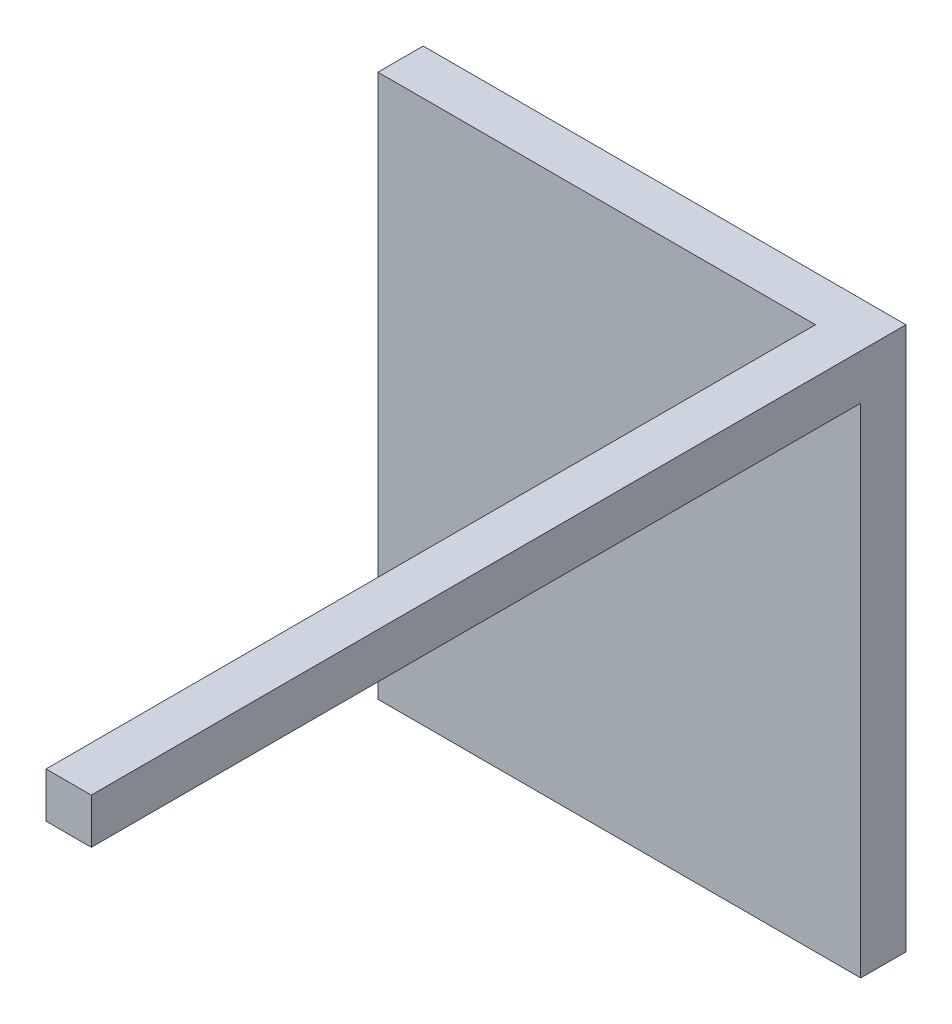
ISO-10303-21;
HEADER;
FILE_DESCRIPTION(('STEP AP214'),'2;1');
FILE_NAME('part.step','',(''),(''),'','','');
FILE_SCHEMA(('AUTOMOTIVE_DESIGN { 1 0 10303 214 1 1 1 1 }'));
ENDSEC;
DATA;
#1=APPLICATION_CONTEXT('core data for automotive mechanical design processes');
#2=APPLICATION_PROTOCOL_DEFINITION('international standard','automotive_design',2000,#1);
#3=PRODUCT_CONTEXT('',#1,'mechanical');
#4=PRODUCT('Part','Part','',(#3));
#5=PRODUCT_RELATED_PRODUCT_CATEGORY('part','',(#4));
#6=PRODUCT_DEFINITION_FORMATION('','',#4);
#7=PRODUCT_DEFINITION_CONTEXT('part definition',#1,'design');
#8=PRODUCT_DEFINITION('design','',#6,#7);
#9=PRODUCT_DEFINITION_SHAPE('','',#8);
#10=(LENGTH_UNIT() NAMED_UNIT(*) SI_UNIT(.MILLI.,.METRE.));
#11=(NAMED_UNIT(*) PLANE_ANGLE_UNIT() SI_UNIT($,.RADIAN.));
#12=(NAMED_UNIT(*) SI_UNIT($,.STERADIAN.) SOLID_ANGLE_UNIT());
#13=UNCERTAINTY_MEASURE_WITH_UNIT(LENGTH_MEASURE(1.E-05),#10,'distance_accuracy_value','');
#14=(GEOMETRIC_REPRESENTATION_CONTEXT(3) GLOBAL_UNCERTAINTY_ASSIGNED_CONTEXT((#13)) GLOBAL_UNIT_ASSIGNED_CONTEXT((#10,
#11,#12)) REPRESENTATION_CONTEXT('',''));
#15=CARTESIAN_POINT('',(0.,0.,0.));
#16=DIRECTION('',(0.,0.,1.));
#17=DIRECTION('',(1.,0.,0.));
#18=AXIS2_PLACEMENT_3D('',#15,#16,#17);
#19=CARTESIAN_POINT('',(0.,228.6,38.1));
#20=DIRECTION('',(-1.,0.,0.));
#21=DIRECTION('',(0.,0.,1.));
#22=AXIS2_PLACEMENT_3D('',#19,#20,#21);
#23=PLANE('',#22);
#24=DIRECTION('',(0.,1.,0.));
#25=VECTOR('',#24,1.);
#26=CARTESIAN_POINT('',(0.,228.6,0.));
#27=LINE('',#26,#25);
#28=CARTESIAN_POINT('',(0.,0.,0.));
#29=VERTEX_POINT('',#28);
#30=CARTESIAN_POINT('',(0.,457.2,0.));
#31=VERTEX_POINT('',#30);
#32=EDGE_CURVE('E119',#29,#31,#27,.T.);
#33=ORIENTED_EDGE('',*,*,#32,.F.);
#34=DIRECTION('',(0.,0.,-1.));
#35=VECTOR('',#34,1.);
#36=CARTESIAN_POINT('',(0.,0.,38.1));
#37=LINE('',#36,#35);
#38=CARTESIAN_POINT('',(0.,0.,38.1));
#39=VERTEX_POINT('',#38);
#40=EDGE_CURVE('E10',#39,#29,#37,.T.);
#41=ORIENTED_EDGE('',*,*,#40,.F.);
#42=DIRECTION('',(0.,1.,0.));
#43=VECTOR('',#42,1.);
#44=CARTESIAN_POINT('',(0.,228.6,38.1));
#45=LINE('',#44,#43);
#46=CARTESIAN_POINT('',(0.,457.2,38.1));
#47=VERTEX_POINT('',#46);
#48=EDGE_CURVE('E132',#39,#47,#45,.T.);
#49=ORIENTED_EDGE('',*,*,#48,.T.);
#50=DIRECTION('',(0.,0.,-1.));
#51=VECTOR('',#50,1.);
#52=CARTESIAN_POINT('',(0.,457.2,38.1));
#53=LINE('',#52,#51);
#54=EDGE_CURVE('E145',#47,#31,#53,.T.);
#55=ORIENTED_EDGE('',*,*,#54,.T.);
#56=EDGE_LOOP('',(#33,#41,#49,#55));
#57=FACE_BOUND('',#56,.T.);
#58=ADVANCED_FACE('F17',(#57),#23,.T.);
#59=CARTESIAN_POINT('',(213.359993903296,0.,38.1));
#60=DIRECTION('',(0.,1.,0.));
#61=DIRECTION('',(0.,0.,1.));
#62=AXIS2_PLACEMENT_3D('',#59,#60,#61);
#63=PLANE('',#62);
#64=DIRECTION('',(1.,0.,0.));
#65=VECTOR('',#64,1.);
#66=CARTESIAN_POINT('',(213.359993903296,0.,0.));
#67=LINE('',#66,#65);
#68=CARTESIAN_POINT('',(406.4,0.,0.));
#69=VERTEX_POINT('',#68);
#70=EDGE_CURVE('E126',#29,#69,#67,.T.);
#71=ORIENTED_EDGE('',*,*,#70,.T.);
#72=DIRECTION('',(0.,0.,-1.));
#73=VECTOR('',#72,1.);
#74=CARTESIAN_POINT('',(406.4,0.,38.1));
#75=LINE('',#74,#73);
#76=CARTESIAN_POINT('',(406.4,0.,38.1));
#77=VERTEX_POINT('',#76);
#78=EDGE_CURVE('E25',#77,#69,#75,.T.);
#79=ORIENTED_EDGE('',*,*,#78,.F.);
#80=DIRECTION('',(1.,0.,0.));
#81=VECTOR('',#80,1.);
#82=CARTESIAN_POINT('',(213.359993903296,0.,38.1));
#83=LINE('',#82,#81);
#84=EDGE_CURVE('E136',#39,#77,#83,.T.);
#85=ORIENTED_EDGE('',*,*,#84,.F.);
#86=ORIENTED_EDGE('',*,*,#40,.T.);
#87=EDGE_LOOP('',(#71,#79,#85,#86));
#88=FACE_BOUND('',#87,.T.);
#89=ADVANCED_FACE('F190',(#88),#63,.F.);
#90=CARTESIAN_POINT('',(406.4,228.6,38.1));
#91=DIRECTION('',(-1.,0.,0.));
#92=DIRECTION('',(0.,-1.,0.));
#93=AXIS2_PLACEMENT_3D('',#90,#91,#92);
#94=PLANE('',#93);
#95=DIRECTION('',(0.,1.,0.));
#96=VECTOR('',#95,1.);
#97=CARTESIAN_POINT('',(406.4,228.6,0.));
#98=LINE('',#97,#96);
#99=CARTESIAN_POINT('',(406.4,457.2,0.));
#100=VERTEX_POINT('',#99);
#101=EDGE_CURVE('E149',#69,#100,#98,.T.);
#102=ORIENTED_EDGE('',*,*,#101,.T.);
#103=DIRECTION('',(0.,0.,-1.));
#104=VECTOR('',#103,1.);
#105=CARTESIAN_POINT('',(406.4,457.2,38.1));
#106=LINE('',#105,#104);
#107=CARTESIAN_POINT('',(406.4,457.2,685.8));
#108=VERTEX_POINT('',#107);
#109=EDGE_CURVE('E158',#108,#100,#106,.T.);
#110=ORIENTED_EDGE('',*,*,#109,.F.);
#111=DIRECTION('',(0.,1.,0.));
#112=VECTOR('',#111,1.);
#113=CARTESIAN_POINT('',(406.4,228.6,685.8));
#114=LINE('',#113,#112);
#115=CARTESIAN_POINT('',(406.4,419.1,685.8));
#116=VERTEX_POINT('',#115);
#117=EDGE_CURVE('E105',#116,#108,#114,.T.);
#118=ORIENTED_EDGE('',*,*,#117,.F.);
#119=DIRECTION('',(0.,0.,-1.));
#120=VECTOR('',#119,1.);
#121=CARTESIAN_POINT('',(406.4,419.1,685.8));
#122=LINE('',#121,#120);
#123=CARTESIAN_POINT('',(406.4,419.1,38.1));
#124=VERTEX_POINT('',#123);
#125=EDGE_CURVE('E100',#116,#124,#122,.T.);
#126=ORIENTED_EDGE('',*,*,#125,.T.);
#127=DIRECTION('',(0.,1.,0.));
#128=VECTOR('',#127,1.);
#129=CARTESIAN_POINT('',(406.4,228.6,38.1));
#130=LINE('',#129,#128);
#131=EDGE_CURVE('E140',#77,#124,#130,.T.);
#132=ORIENTED_EDGE('',*,*,#131,.F.);
#133=ORIENTED_EDGE('',*,*,#78,.T.);
#134=EDGE_LOOP('',(#102,#110,#118,#126,#132,#133));
#135=FACE_BOUND('',#134,.T.);
#136=ADVANCED_FACE('F167',(#135),#94,.F.);
#137=CARTESIAN_POINT('',(243.840006096703,457.2,38.1));
#138=DIRECTION('',(0.,1.,0.));
#139=DIRECTION('',(0.,0.,1.));
#140=AXIS2_PLACEMENT_3D('',#137,#138,#139);
#141=PLANE('',#140);
#142=DIRECTION('',(1.,0.,0.));
#143=VECTOR('',#142,1.);
#144=CARTESIAN_POINT('',(243.840006096703,457.2,0.));
#145=LINE('',#144,#143);
#146=EDGE_CURVE('E137',#31,#100,#145,.T.);
#147=ORIENTED_EDGE('',*,*,#146,.F.);
#148=ORIENTED_EDGE('',*,*,#54,.F.);
#149=DIRECTION('',(1.,0.,0.));
#150=VECTOR('',#149,1.);
#151=CARTESIAN_POINT('',(243.840006096703,457.2,38.1));
#152=LINE('',#151,#150);
#153=CARTESIAN_POINT('',(368.3,457.2,38.1));
#154=VERTEX_POINT('',#153);
#155=EDGE_CURVE('E143',#47,#154,#152,.T.);
#156=ORIENTED_EDGE('',*,*,#155,.T.);
#157=DIRECTION('',(0.,0.,-1.));
#158=VECTOR('',#157,1.);
#159=CARTESIAN_POINT('',(368.3,457.2,685.8));
#160=LINE('',#159,#158);
#161=CARTESIAN_POINT('',(368.3,457.2,685.8));
#162=VERTEX_POINT('',#161);
#163=EDGE_CURVE('E128',#162,#154,#160,.T.);
#164=ORIENTED_EDGE('',*,*,#163,.F.);
#165=DIRECTION('',(1.,0.,0.));
#166=VECTOR('',#165,1.);
#167=CARTESIAN_POINT('',(243.840006096703,457.2,685.8));
#168=LINE('',#167,#166);
#169=EDGE_CURVE('E112',#162,#108,#168,.T.);
#170=ORIENTED_EDGE('',*,*,#169,.T.);
#171=ORIENTED_EDGE('',*,*,#109,.T.);
#172=EDGE_LOOP('',(#147,#148,#156,#164,#170,#171));
#173=FACE_BOUND('',#172,.T.);
#174=ADVANCED_FACE('F176',(#173),#141,.T.);
#175=CARTESIAN_POINT('',(203.2,228.6,38.1));
#176=DIRECTION('',(0.,0.,1.));
#177=DIRECTION('',(1.,0.,0.));
#178=AXIS2_PLACEMENT_3D('',#175,#176,#177);
#179=PLANE('',#178);
#180=DIRECTION('',(0.,-1.,0.));
#181=VECTOR('',#180,1.);
#182=CARTESIAN_POINT('',(368.3,446.850213599205,38.1));
#183=LINE('',#182,#181);
#184=CARTESIAN_POINT('',(368.3,419.1,38.1));
#185=VERTEX_POINT('',#184);
#186=EDGE_CURVE('E44',#154,#185,#183,.T.);
#187=ORIENTED_EDGE('',*,*,#186,.F.);
#188=ORIENTED_EDGE('',*,*,#155,.F.);
#189=ORIENTED_EDGE('',*,*,#48,.F.);
#190=ORIENTED_EDGE('',*,*,#84,.T.);
#191=ORIENTED_EDGE('',*,*,#131,.T.);
#192=DIRECTION('',(1.,0.,0.));
#193=VECTOR('',#192,1.);
#194=CARTESIAN_POINT('',(431.796451067925,419.1,38.1));
#195=LINE('',#194,#193);
#196=EDGE_CURVE('E37',#185,#124,#195,.T.);
#197=ORIENTED_EDGE('',*,*,#196,.F.);
#198=EDGE_LOOP('',(#187,#188,#189,#190,#191,#197));
#199=FACE_BOUND('',#198,.T.);
#200=ADVANCED_FACE('F188',(#199),#179,.T.);
#201=CARTESIAN_POINT('',(203.2,228.6,0.));
#202=DIRECTION('',(0.,0.,1.));
#203=DIRECTION('',(1.,0.,0.));
#204=AXIS2_PLACEMENT_3D('',#201,#202,#203);
#205=PLANE('',#204);
#206=ORIENTED_EDGE('',*,*,#32,.T.);
#207=ORIENTED_EDGE('',*,*,#146,.T.);
#208=ORIENTED_EDGE('',*,*,#101,.F.);
#209=ORIENTED_EDGE('',*,*,#70,.F.);
#210=EDGE_LOOP('',(#206,#207,#208,#209));
#211=FACE_BOUND('',#210,.T.);
#212=ADVANCED_FACE('F172',(#211),#205,.F.);
#213=CARTESIAN_POINT('',(368.3,446.850213599205,685.8));
#214=DIRECTION('',(1.,0.,0.));
#215=DIRECTION('',(0.,1.,0.));
#216=AXIS2_PLACEMENT_3D('',#213,#214,#215);
#217=PLANE('',#216);
#218=ORIENTED_EDGE('',*,*,#186,.T.);
#219=DIRECTION('',(0.,0.,-1.));
#220=VECTOR('',#219,1.);
#221=CARTESIAN_POINT('',(368.3,419.1,685.8));
#222=LINE('',#221,#220);
#223=CARTESIAN_POINT('',(368.3,419.1,685.8));
#224=VERTEX_POINT('',#223);
#225=EDGE_CURVE('E98',#224,#185,#222,.T.);
#226=ORIENTED_EDGE('',*,*,#225,.F.);
#227=DIRECTION('',(0.,-1.,0.));
#228=VECTOR('',#227,1.);
#229=CARTESIAN_POINT('',(368.3,446.850213599205,685.8));
#230=LINE('',#229,#228);
#231=EDGE_CURVE('E106',#162,#224,#230,.T.);
#232=ORIENTED_EDGE('',*,*,#231,.F.);
#233=ORIENTED_EDGE('',*,*,#163,.T.);
#234=EDGE_LOOP('',(#218,#226,#232,#233));
#235=FACE_BOUND('',#234,.T.);
#236=ADVANCED_FACE('F117',(#235),#217,.F.);
#237=CARTESIAN_POINT('',(431.796451067925,419.1,685.8));
#238=DIRECTION('',(0.,1.,0.));
#239=DIRECTION('',(0.,0.,1.));
#240=AXIS2_PLACEMENT_3D('',#237,#238,#239);
#241=PLANE('',#240);
#242=ORIENTED_EDGE('',*,*,#196,.T.);
#243=ORIENTED_EDGE('',*,*,#125,.F.);
#244=DIRECTION('',(1.,0.,0.));
#245=VECTOR('',#244,1.);
#246=CARTESIAN_POINT('',(431.796451067925,419.1,685.8));
#247=LINE('',#246,#245);
#248=EDGE_CURVE('E94',#224,#116,#247,.T.);
#249=ORIENTED_EDGE('',*,*,#248,.F.);
#250=ORIENTED_EDGE('',*,*,#225,.T.);
#251=EDGE_LOOP('',(#242,#243,#249,#250));
#252=FACE_BOUND('',#251,.T.);
#253=ADVANCED_FACE('F96',(#252),#241,.F.);
#254=CARTESIAN_POINT('',(203.2,228.6,685.8));
#255=DIRECTION('',(0.,0.,1.));
#256=DIRECTION('',(1.,0.,0.));
#257=AXIS2_PLACEMENT_3D('',#254,#255,#256);
#258=PLANE('',#257);
#259=ORIENTED_EDGE('',*,*,#231,.T.);
#260=ORIENTED_EDGE('',*,*,#248,.T.);
#261=ORIENTED_EDGE('',*,*,#117,.T.);
#262=ORIENTED_EDGE('',*,*,#169,.F.);
#263=EDGE_LOOP('',(#259,#260,#261,#262));
#264=FACE_BOUND('',#263,.T.);
#265=ADVANCED_FACE('F110',(#264),#258,.T.);
#266=CLOSED_SHELL('',(#58,#89,#136,#174,#200,#212,#236,#253,#265));
#267=MANIFOLD_SOLID_BREP('B1',#266);
#268=ADVANCED_BREP_SHAPE_REPRESENTATION('',(#18,#267),#14);
#269=SHAPE_DEFINITION_REPRESENTATION(#9,#268);
ENDSEC;
END-ISO-10303-21;
